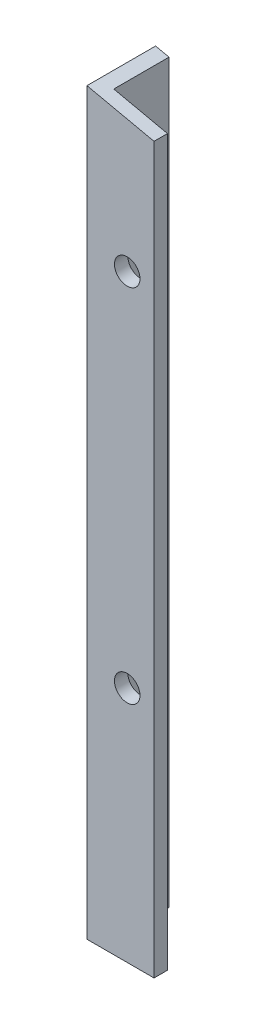
ISO-10303-21;
HEADER;
FILE_DESCRIPTION(('STEP AP214'),'2;1');
FILE_NAME('part.step','',(''),(''),'','','');
FILE_SCHEMA(('AUTOMOTIVE_DESIGN { 1 0 10303 214 1 1 1 1 }'));
ENDSEC;
DATA;
#1=APPLICATION_CONTEXT('core data for automotive mechanical design processes');
#2=APPLICATION_PROTOCOL_DEFINITION('international standard','automotive_design',2000,#1);
#3=PRODUCT_CONTEXT('',#1,'mechanical');
#4=PRODUCT('Part','Part','',(#3));
#5=PRODUCT_RELATED_PRODUCT_CATEGORY('part','',(#4));
#6=PRODUCT_DEFINITION_FORMATION('','',#4);
#7=PRODUCT_DEFINITION_CONTEXT('part definition',#1,'design');
#8=PRODUCT_DEFINITION('design','',#6,#7);
#9=PRODUCT_DEFINITION_SHAPE('','',#8);
#10=(LENGTH_UNIT() NAMED_UNIT(*) SI_UNIT(.MILLI.,.METRE.));
#11=(NAMED_UNIT(*) PLANE_ANGLE_UNIT() SI_UNIT($,.RADIAN.));
#12=(NAMED_UNIT(*) SI_UNIT($,.STERADIAN.) SOLID_ANGLE_UNIT());
#13=UNCERTAINTY_MEASURE_WITH_UNIT(LENGTH_MEASURE(1.E-05),#10,'distance_accuracy_value','');
#14=(GEOMETRIC_REPRESENTATION_CONTEXT(3) GLOBAL_UNCERTAINTY_ASSIGNED_CONTEXT((#13)) GLOBAL_UNIT_ASSIGNED_CONTEXT((#10,
#11,#12)) REPRESENTATION_CONTEXT('',''));
#15=CARTESIAN_POINT('',(0.,0.,0.));
#16=DIRECTION('',(0.,0.,1.));
#17=DIRECTION('',(1.,0.,0.));
#18=AXIS2_PLACEMENT_3D('',#15,#16,#17);
#19=CARTESIAN_POINT('',(0.,140.,0.));
#20=DIRECTION('',(0.,0.,-1.));
#21=DIRECTION('',(-1.,0.,0.));
#22=AXIS2_PLACEMENT_3D('',#19,#20,#21);
#23=PLANE('',#22);
#24=CARTESIAN_POINT('',(7.62,45.,0.));
#25=DIRECTION('',(0.,0.,-1.));
#26=DIRECTION('',(-1.,0.,0.));
#27=AXIS2_PLACEMENT_3D('',#24,#25,#26);
#28=CIRCLE('',#27,2.415);
#29=CARTESIAN_POINT('',(5.205,45.,0.));
#30=VERTEX_POINT('',#29);
#31=EDGE_CURVE('E187',#30,#30,#28,.T.);
#32=ORIENTED_EDGE('',*,*,#31,.T.);
#33=EDGE_LOOP('',(#32));
#34=FACE_BOUND('',#33,.T.);
#35=CARTESIAN_POINT('',(7.62,113.331604160853,0.));
#36=DIRECTION('',(0.,0.,-1.));
#37=DIRECTION('',(-1.,0.,0.));
#38=AXIS2_PLACEMENT_3D('',#35,#36,#37);
#39=CIRCLE('',#38,2.415);
#40=CARTESIAN_POINT('',(5.205,113.331604160853,0.));
#41=VERTEX_POINT('',#40);
#42=EDGE_CURVE('E114',#41,#41,#39,.T.);
#43=ORIENTED_EDGE('',*,*,#42,.T.);
#44=EDGE_LOOP('',(#43));
#45=FACE_BOUND('',#44,.T.);
#46=DIRECTION('',(0.,-1.,0.));
#47=VECTOR('',#46,1.);
#48=CARTESIAN_POINT('',(12.7,140.,0.));
#49=LINE('',#48,#47);
#50=CARTESIAN_POINT('',(12.7,137.219340268088,0.));
#51=VERTEX_POINT('',#50);
#52=CARTESIAN_POINT('',(12.7,0.,0.));
#53=VERTEX_POINT('',#52);
#54=EDGE_CURVE('E11',#51,#53,#49,.T.);
#55=ORIENTED_EDGE('',*,*,#54,.F.);
#56=DIRECTION('',(-0.97685929834514,0.213882938161605,0.));
#57=VECTOR('',#56,1.);
#58=CARTESIAN_POINT('',(0.,140.,0.));
#59=LINE('',#58,#57);
#60=CARTESIAN_POINT('',(0.,140.,0.));
#61=VERTEX_POINT('',#60);
#62=EDGE_CURVE('E137',#51,#61,#59,.T.);
#63=ORIENTED_EDGE('',*,*,#62,.T.);
#64=DIRECTION('',(0.,-1.,0.));
#65=VECTOR('',#64,1.);
#66=CARTESIAN_POINT('',(0.,140.,0.));
#67=LINE('',#66,#65);
#68=CARTESIAN_POINT('',(0.,0.,0.));
#69=VERTEX_POINT('',#68);
#70=EDGE_CURVE('E92',#61,#69,#67,.T.);
#71=ORIENTED_EDGE('',*,*,#70,.T.);
#72=DIRECTION('',(1.,0.,0.));
#73=VECTOR('',#72,1.);
#74=CARTESIAN_POINT('',(0.,0.,0.));
#75=LINE('',#74,#73);
#76=EDGE_CURVE('E98',#69,#53,#75,.T.);
#77=ORIENTED_EDGE('',*,*,#76,.T.);
#78=EDGE_LOOP('',(#55,#63,#71,#77));
#79=FACE_BOUND('',#78,.T.);
#80=ADVANCED_FACE('F35',(#34,#45,#79),#23,.F.);
#81=CARTESIAN_POINT('',(12.7,140.,-2.54));
#82=DIRECTION('',(-1.,0.,0.));
#83=DIRECTION('',(0.,0.,1.));
#84=AXIS2_PLACEMENT_3D('',#81,#82,#83);
#85=PLANE('',#84);
#86=DIRECTION('',(0.,-1.,0.));
#87=VECTOR('',#86,1.);
#88=CARTESIAN_POINT('',(12.7,140.,-2.54));
#89=LINE('',#88,#87);
#90=CARTESIAN_POINT('',(12.7,137.219340268088,-2.54));
#91=VERTEX_POINT('',#90);
#92=CARTESIAN_POINT('',(12.7,0.,-2.54));
#93=VERTEX_POINT('',#92);
#94=EDGE_CURVE('E44',#91,#93,#89,.T.);
#95=ORIENTED_EDGE('',*,*,#94,.F.);
#96=DIRECTION('',(0.,0.,1.));
#97=VECTOR('',#96,1.);
#98=CARTESIAN_POINT('',(12.7,137.219340268088,-2.54));
#99=LINE('',#98,#97);
#100=EDGE_CURVE('E134',#91,#51,#99,.T.);
#101=ORIENTED_EDGE('',*,*,#100,.T.);
#102=ORIENTED_EDGE('',*,*,#54,.T.);
#103=DIRECTION('',(0.,0.,-1.));
#104=VECTOR('',#103,1.);
#105=CARTESIAN_POINT('',(12.7,0.,-2.54));
#106=LINE('',#105,#104);
#107=EDGE_CURVE('E141',#53,#93,#106,.T.);
#108=ORIENTED_EDGE('',*,*,#107,.T.);
#109=EDGE_LOOP('',(#95,#101,#102,#108));
#110=FACE_BOUND('',#109,.T.);
#111=ADVANCED_FACE('F158',(#110),#85,.F.);
#112=CARTESIAN_POINT('',(2.54,140.,-2.54));
#113=DIRECTION('',(0.,0.,1.));
#114=DIRECTION('',(1.,0.,0.));
#115=AXIS2_PLACEMENT_3D('',#112,#113,#114);
#116=PLANE('',#115);
#117=CARTESIAN_POINT('',(7.62,45.,-2.54));
#118=DIRECTION('',(0.,0.,-1.));
#119=DIRECTION('',(-1.,0.,0.));
#120=AXIS2_PLACEMENT_3D('',#117,#118,#119);
#121=CIRCLE('',#120,2.415);
#122=CARTESIAN_POINT('',(5.205,45.,-2.54));
#123=VERTEX_POINT('',#122);
#124=EDGE_CURVE('E191',#123,#123,#121,.T.);
#125=ORIENTED_EDGE('',*,*,#124,.F.);
#126=EDGE_LOOP('',(#125));
#127=FACE_BOUND('',#126,.T.);
#128=CARTESIAN_POINT('',(7.62,113.331604160853,-2.54));
#129=DIRECTION('',(0.,0.,-1.));
#130=DIRECTION('',(-1.,0.,0.));
#131=AXIS2_PLACEMENT_3D('',#128,#129,#130);
#132=CIRCLE('',#131,2.415);
#133=CARTESIAN_POINT('',(5.205,113.331604160853,-2.54));
#134=VERTEX_POINT('',#133);
#135=EDGE_CURVE('E109',#134,#134,#132,.T.);
#136=ORIENTED_EDGE('',*,*,#135,.F.);
#137=EDGE_LOOP('',(#136));
#138=FACE_BOUND('',#137,.T.);
#139=DIRECTION('',(0.,-1.,0.));
#140=VECTOR('',#139,1.);
#141=CARTESIAN_POINT('',(2.54,140.,-2.54));
#142=LINE('',#141,#140);
#143=CARTESIAN_POINT('',(2.54,139.443868053618,-2.54));
#144=VERTEX_POINT('',#143);
#145=CARTESIAN_POINT('',(2.54,0.,-2.54));
#146=VERTEX_POINT('',#145);
#147=EDGE_CURVE('E105',#144,#146,#142,.T.);
#148=ORIENTED_EDGE('',*,*,#147,.F.);
#149=DIRECTION('',(0.97685929834514,-0.213882938161605,0.));
#150=VECTOR('',#149,1.);
#151=CARTESIAN_POINT('',(2.42380538545893,139.469308816273,-2.54));
#152=LINE('',#151,#150);
#153=EDGE_CURVE('E131',#144,#91,#152,.T.);
#154=ORIENTED_EDGE('',*,*,#153,.T.);
#155=ORIENTED_EDGE('',*,*,#94,.T.);
#156=DIRECTION('',(-1.,0.,0.));
#157=VECTOR('',#156,1.);
#158=CARTESIAN_POINT('',(2.54,0.,-2.54));
#159=LINE('',#158,#157);
#160=EDGE_CURVE('E144',#93,#146,#159,.T.);
#161=ORIENTED_EDGE('',*,*,#160,.T.);
#162=EDGE_LOOP('',(#148,#154,#155,#161));
#163=FACE_BOUND('',#162,.T.);
#164=ADVANCED_FACE('F152',(#127,#138,#163),#116,.F.);
#165=CARTESIAN_POINT('',(2.54,140.,-12.99972));
#166=DIRECTION('',(-1.,0.,0.));
#167=DIRECTION('',(0.,0.,1.));
#168=AXIS2_PLACEMENT_3D('',#165,#166,#167);
#169=PLANE('',#168);
#170=CARTESIAN_POINT('',(2.54,60.,-7.76986));
#171=DIRECTION('',(1.,0.,0.));
#172=DIRECTION('',(0.,0.,-1.));
#173=AXIS2_PLACEMENT_3D('',#170,#171,#172);
#174=CIRCLE('',#173,2.415);
#175=CARTESIAN_POINT('',(2.54,60.,-10.18486));
#176=VERTEX_POINT('',#175);
#177=EDGE_CURVE('E121',#176,#176,#174,.T.);
#178=ORIENTED_EDGE('',*,*,#177,.F.);
#179=EDGE_LOOP('',(#178));
#180=FACE_BOUND('',#179,.T.);
#181=CARTESIAN_POINT('',(2.54,94.4438680536175,-7.76986));
#182=DIRECTION('',(1.,0.,0.));
#183=DIRECTION('',(0.,0.,-1.));
#184=AXIS2_PLACEMENT_3D('',#181,#182,#183);
#185=CIRCLE('',#184,2.415);
#186=CARTESIAN_POINT('',(2.54,94.4438680536175,-10.18486));
#187=VERTEX_POINT('',#186);
#188=EDGE_CURVE('E110',#187,#187,#185,.T.);
#189=ORIENTED_EDGE('',*,*,#188,.F.);
#190=EDGE_LOOP('',(#189));
#191=FACE_BOUND('',#190,.T.);
#192=DIRECTION('',(0.,-1.,0.));
#193=VECTOR('',#192,1.);
#194=CARTESIAN_POINT('',(2.54,140.,-12.99972));
#195=LINE('',#194,#193);
#196=CARTESIAN_POINT('',(2.54,139.443868053618,-12.99972));
#197=VERTEX_POINT('',#196);
#198=CARTESIAN_POINT('',(2.54,0.,-12.99972));
#199=VERTEX_POINT('',#198);
#200=EDGE_CURVE('E79',#197,#199,#195,.T.);
#201=ORIENTED_EDGE('',*,*,#200,.F.);
#202=DIRECTION('',(0.,0.,1.));
#203=VECTOR('',#202,1.);
#204=CARTESIAN_POINT('',(2.54,139.443868053618,-12.99972));
#205=LINE('',#204,#203);
#206=EDGE_CURVE('E128',#197,#144,#205,.T.);
#207=ORIENTED_EDGE('',*,*,#206,.T.);
#208=ORIENTED_EDGE('',*,*,#147,.T.);
#209=DIRECTION('',(0.,0.,-1.));
#210=VECTOR('',#209,1.);
#211=CARTESIAN_POINT('',(2.54,0.,-12.99972));
#212=LINE('',#211,#210);
#213=EDGE_CURVE('E85',#146,#199,#212,.T.);
#214=ORIENTED_EDGE('',*,*,#213,.T.);
#215=EDGE_LOOP('',(#201,#207,#208,#214));
#216=FACE_BOUND('',#215,.T.);
#217=ADVANCED_FACE('F147',(#180,#191,#216),#169,.F.);
#218=CARTESIAN_POINT('',(0.,140.,-12.99972));
#219=DIRECTION('',(0.,0.,1.));
#220=DIRECTION('',(1.,0.,0.));
#221=AXIS2_PLACEMENT_3D('',#218,#219,#220);
#222=PLANE('',#221);
#223=DIRECTION('',(0.,-1.,0.));
#224=VECTOR('',#223,1.);
#225=CARTESIAN_POINT('',(0.,140.,-12.99972));
#226=LINE('',#225,#224);
#227=CARTESIAN_POINT('',(0.,140.,-12.99972));
#228=VERTEX_POINT('',#227);
#229=CARTESIAN_POINT('',(0.,0.,-12.99972));
#230=VERTEX_POINT('',#229);
#231=EDGE_CURVE('E76',#228,#230,#226,.T.);
#232=ORIENTED_EDGE('',*,*,#231,.F.);
#233=DIRECTION('',(0.97685929834514,-0.213882938161605,0.));
#234=VECTOR('',#233,1.);
#235=CARTESIAN_POINT('',(0.,140.,-12.99972));
#236=LINE('',#235,#234);
#237=EDGE_CURVE('E52',#228,#197,#236,.T.);
#238=ORIENTED_EDGE('',*,*,#237,.T.);
#239=ORIENTED_EDGE('',*,*,#200,.T.);
#240=DIRECTION('',(-1.,0.,0.));
#241=VECTOR('',#240,1.);
#242=CARTESIAN_POINT('',(0.,0.,-12.99972));
#243=LINE('',#242,#241);
#244=EDGE_CURVE('E73',#199,#230,#243,.T.);
#245=ORIENTED_EDGE('',*,*,#244,.T.);
#246=EDGE_LOOP('',(#232,#238,#239,#245));
#247=FACE_BOUND('',#246,.T.);
#248=ADVANCED_FACE('F75',(#247),#222,.F.);
#249=CARTESIAN_POINT('',(0.,140.,0.));
#250=DIRECTION('',(1.,0.,0.));
#251=DIRECTION('',(0.,0.,-1.));
#252=AXIS2_PLACEMENT_3D('',#249,#250,#251);
#253=PLANE('',#252);
#254=CARTESIAN_POINT('',(0.,60.,-7.76986));
#255=DIRECTION('',(1.,0.,0.));
#256=DIRECTION('',(0.,0.,-1.));
#257=AXIS2_PLACEMENT_3D('',#254,#255,#256);
#258=CIRCLE('',#257,2.415);
#259=CARTESIAN_POINT('',(0.,60.,-10.18486));
#260=VERTEX_POINT('',#259);
#261=EDGE_CURVE('E38',#260,#260,#258,.T.);
#262=ORIENTED_EDGE('',*,*,#261,.T.);
#263=EDGE_LOOP('',(#262));
#264=FACE_BOUND('',#263,.T.);
#265=CARTESIAN_POINT('',(0.,94.4438680536175,-7.76986));
#266=DIRECTION('',(1.,0.,0.));
#267=DIRECTION('',(0.,0.,-1.));
#268=AXIS2_PLACEMENT_3D('',#265,#266,#267);
#269=CIRCLE('',#268,2.415);
#270=CARTESIAN_POINT('',(0.,94.4438680536175,-10.18486));
#271=VERTEX_POINT('',#270);
#272=EDGE_CURVE('E107',#271,#271,#269,.T.);
#273=ORIENTED_EDGE('',*,*,#272,.T.);
#274=EDGE_LOOP('',(#273));
#275=FACE_BOUND('',#274,.T.);
#276=DIRECTION('',(0.,0.,1.));
#277=VECTOR('',#276,1.);
#278=CARTESIAN_POINT('',(0.,0.,0.));
#279=LINE('',#278,#277);
#280=EDGE_CURVE('E84',#230,#69,#279,.T.);
#281=ORIENTED_EDGE('',*,*,#280,.T.);
#282=ORIENTED_EDGE('',*,*,#70,.F.);
#283=DIRECTION('',(0.,0.,1.));
#284=VECTOR('',#283,1.);
#285=CARTESIAN_POINT('',(0.,140.,0.));
#286=LINE('',#285,#284);
#287=EDGE_CURVE('E91',#228,#61,#286,.T.);
#288=ORIENTED_EDGE('',*,*,#287,.F.);
#289=ORIENTED_EDGE('',*,*,#231,.T.);
#290=EDGE_LOOP('',(#281,#282,#288,#289));
#291=FACE_BOUND('',#290,.T.);
#292=ADVANCED_FACE('F88',(#264,#275,#291),#253,.F.);
#293=CARTESIAN_POINT('',(0.,0.,0.));
#294=DIRECTION('',(0.,-1.,0.));
#295=DIRECTION('',(0.,0.,-1.));
#296=AXIS2_PLACEMENT_3D('',#293,#294,#295);
#297=PLANE('',#296);
#298=ORIENTED_EDGE('',*,*,#76,.F.);
#299=ORIENTED_EDGE('',*,*,#280,.F.);
#300=ORIENTED_EDGE('',*,*,#244,.F.);
#301=ORIENTED_EDGE('',*,*,#213,.F.);
#302=ORIENTED_EDGE('',*,*,#160,.F.);
#303=ORIENTED_EDGE('',*,*,#107,.F.);
#304=EDGE_LOOP('',(#298,#299,#300,#301,#302,#303));
#305=FACE_BOUND('',#304,.T.);
#306=ADVANCED_FACE('F95',(#305),#297,.T.);
#307=CARTESIAN_POINT('',(29.2506951660759,133.59557242687,-20.89));
#308=DIRECTION('',(-0.213882938161605,-0.97685929834514,0.));
#309=DIRECTION('',(0.97685929834514,-0.213882938161605,0.));
#310=AXIS2_PLACEMENT_3D('',#307,#308,#309);
#311=PLANE('',#310);
#312=ORIENTED_EDGE('',*,*,#100,.F.);
#313=ORIENTED_EDGE('',*,*,#153,.F.);
#314=ORIENTED_EDGE('',*,*,#206,.F.);
#315=ORIENTED_EDGE('',*,*,#237,.F.);
#316=ORIENTED_EDGE('',*,*,#287,.T.);
#317=ORIENTED_EDGE('',*,*,#62,.F.);
#318=EDGE_LOOP('',(#312,#313,#314,#315,#316,#317));
#319=FACE_BOUND('',#318,.T.);
#320=ADVANCED_FACE('F167',(#319),#311,.F.);
#321=CARTESIAN_POINT('',(7.62,113.331604160853,7.46));
#322=DIRECTION('',(0.,0.,-1.));
#323=DIRECTION('',(-1.,0.,0.));
#324=AXIS2_PLACEMENT_3D('',#321,#322,#323);
#325=CYLINDRICAL_SURFACE('',#324,2.415);
#326=ORIENTED_EDGE('',*,*,#135,.T.);
#327=EDGE_LOOP('',(#326));
#328=FACE_BOUND('',#327,.T.);
#329=ORIENTED_EDGE('',*,*,#42,.F.);
#330=EDGE_LOOP('',(#329));
#331=FACE_BOUND('',#330,.T.);
#332=ADVANCED_FACE('F169',(#328,#331),#325,.F.);
#333=CARTESIAN_POINT('',(-7.46,94.4438680536175,-7.76986));
#334=DIRECTION('',(1.,0.,0.));
#335=DIRECTION('',(0.,0.,-1.));
#336=AXIS2_PLACEMENT_3D('',#333,#334,#335);
#337=CYLINDRICAL_SURFACE('',#336,2.415);
#338=ORIENTED_EDGE('',*,*,#188,.T.);
#339=EDGE_LOOP('',(#338));
#340=FACE_BOUND('',#339,.T.);
#341=ORIENTED_EDGE('',*,*,#272,.F.);
#342=EDGE_LOOP('',(#341));
#343=FACE_BOUND('',#342,.T.);
#344=ADVANCED_FACE('F175',(#340,#343),#337,.F.);
#345=CARTESIAN_POINT('',(-7.46,60.,-7.76986));
#346=DIRECTION('',(1.,0.,0.));
#347=DIRECTION('',(0.,0.,-1.));
#348=AXIS2_PLACEMENT_3D('',#345,#346,#347);
#349=CYLINDRICAL_SURFACE('',#348,2.415);
#350=ORIENTED_EDGE('',*,*,#177,.T.);
#351=EDGE_LOOP('',(#350));
#352=FACE_BOUND('',#351,.T.);
#353=ORIENTED_EDGE('',*,*,#261,.F.);
#354=EDGE_LOOP('',(#353));
#355=FACE_BOUND('',#354,.T.);
#356=ADVANCED_FACE('F217',(#352,#355),#349,.F.);
#357=CARTESIAN_POINT('',(7.62,45.,7.46));
#358=DIRECTION('',(0.,0.,-1.));
#359=DIRECTION('',(-1.,0.,0.));
#360=AXIS2_PLACEMENT_3D('',#357,#358,#359);
#361=CYLINDRICAL_SURFACE('',#360,2.415);
#362=ORIENTED_EDGE('',*,*,#124,.T.);
#363=EDGE_LOOP('',(#362));
#364=FACE_BOUND('',#363,.T.);
#365=ORIENTED_EDGE('',*,*,#31,.F.);
#366=EDGE_LOOP('',(#365));
#367=FACE_BOUND('',#366,.T.);
#368=ADVANCED_FACE('F197',(#364,#367),#361,.F.);
#369=CLOSED_SHELL('',(#80,#111,#164,#217,#248,#292,#306,#320,#332,#344,#356,#368));
#370=MANIFOLD_SOLID_BREP('B2',#369);
#371=ADVANCED_BREP_SHAPE_REPRESENTATION('',(#18,#370),#14);
#372=SHAPE_DEFINITION_REPRESENTATION(#9,#371);
ENDSEC;
END-ISO-10303-21;
